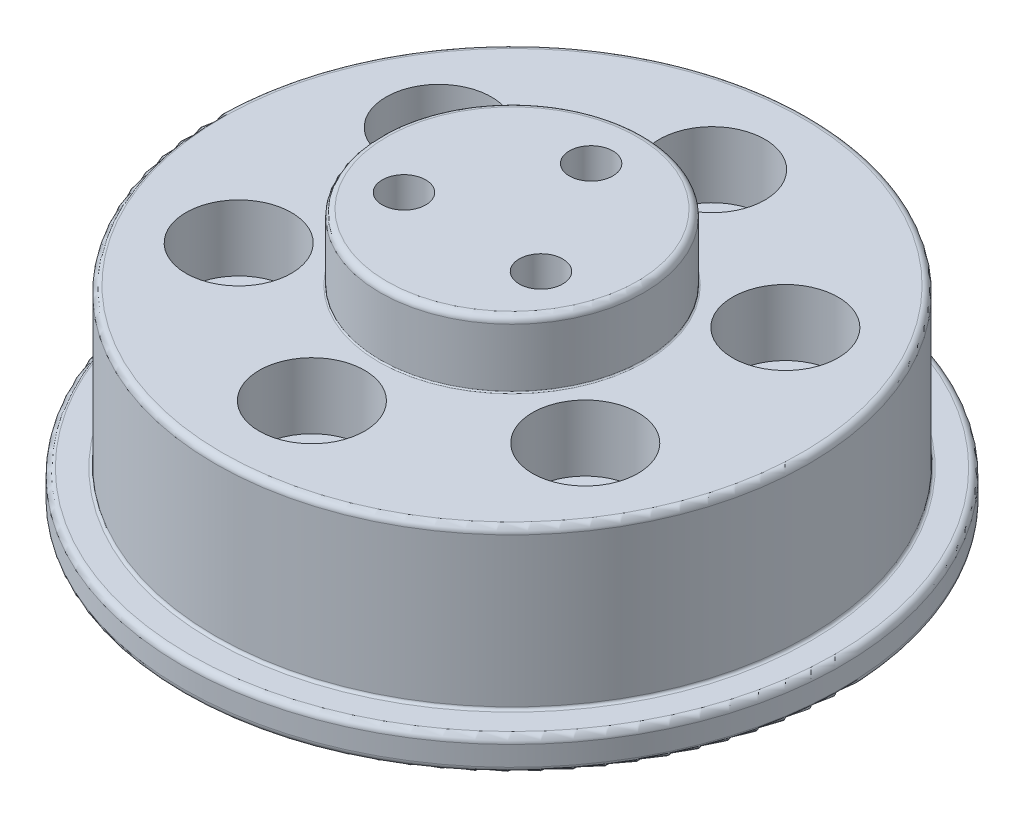
ISO-10303-21;
HEADER;
FILE_DESCRIPTION(('STEP AP214'),'2;1');
FILE_NAME('part.step','',(''),(''),'','','');
FILE_SCHEMA(('AUTOMOTIVE_DESIGN { 1 0 10303 214 1 1 1 1 }'));
ENDSEC;
DATA;
#1=APPLICATION_CONTEXT('core data for automotive mechanical design processes');
#2=APPLICATION_PROTOCOL_DEFINITION('international standard','automotive_design',2000,#1);
#3=PRODUCT_CONTEXT('',#1,'mechanical');
#4=PRODUCT('Part','Part','',(#3));
#5=PRODUCT_RELATED_PRODUCT_CATEGORY('part','',(#4));
#6=PRODUCT_DEFINITION_FORMATION('','',#4);
#7=PRODUCT_DEFINITION_CONTEXT('part definition',#1,'design');
#8=PRODUCT_DEFINITION('design','',#6,#7);
#9=PRODUCT_DEFINITION_SHAPE('','',#8);
#10=(LENGTH_UNIT() NAMED_UNIT(*) SI_UNIT(.MILLI.,.METRE.));
#11=(NAMED_UNIT(*) PLANE_ANGLE_UNIT() SI_UNIT($,.RADIAN.));
#12=(NAMED_UNIT(*) SI_UNIT($,.STERADIAN.) SOLID_ANGLE_UNIT());
#13=UNCERTAINTY_MEASURE_WITH_UNIT(LENGTH_MEASURE(1.E-05),#10,'distance_accuracy_value','');
#14=(GEOMETRIC_REPRESENTATION_CONTEXT(3) GLOBAL_UNCERTAINTY_ASSIGNED_CONTEXT((#13)) GLOBAL_UNIT_ASSIGNED_CONTEXT((#10,
#11,#12)) REPRESENTATION_CONTEXT('',''));
#15=CARTESIAN_POINT('',(0.,0.,0.));
#16=DIRECTION('',(0.,0.,1.));
#17=DIRECTION('',(1.,0.,0.));
#18=AXIS2_PLACEMENT_3D('',#15,#16,#17);
#19=CARTESIAN_POINT('',(0.,2.5,0.));
#20=DIRECTION('',(0.,-1.,0.));
#21=DIRECTION('',(0.,0.,-1.));
#22=AXIS2_PLACEMENT_3D('',#19,#20,#21);
#23=CYLINDRICAL_SURFACE('',#22,10.1);
#24=CARTESIAN_POINT('',(0.,0.5,0.));
#25=DIRECTION('',(0.,1.,0.));
#26=DIRECTION('',(0.,0.,1.));
#27=AXIS2_PLACEMENT_3D('',#24,#25,#26);
#28=CIRCLE('',#27,10.1);
#29=CARTESIAN_POINT('',(0.,0.5,10.1));
#30=VERTEX_POINT('',#29);
#31=EDGE_CURVE('E153',#30,#30,#28,.T.);
#32=ORIENTED_EDGE('',*,*,#31,.T.);
#33=EDGE_LOOP('',(#32));
#34=FACE_BOUND('',#33,.T.);
#35=CARTESIAN_POINT('',(0.,2.,0.));
#36=DIRECTION('',(0.,1.,0.));
#37=DIRECTION('',(0.,0.,1.));
#38=AXIS2_PLACEMENT_3D('',#35,#36,#37);
#39=CIRCLE('',#38,10.1);
#40=CARTESIAN_POINT('',(0.,2.,10.1));
#41=VERTEX_POINT('',#40);
#42=EDGE_CURVE('E140',#41,#41,#39,.F.);
#43=ORIENTED_EDGE('',*,*,#42,.T.);
#44=EDGE_LOOP('',(#43));
#45=FACE_BOUND('',#44,.T.);
#46=ADVANCED_FACE('F33',(#34,#45),#23,.T.);
#47=CARTESIAN_POINT('',(0.,0.,0.));
#48=DIRECTION('',(0.,1.,0.));
#49=DIRECTION('',(0.,0.,1.));
#50=AXIS2_PLACEMENT_3D('',#47,#48,#49);
#51=PLANE('',#50);
#52=CARTESIAN_POINT('',(0.,0.,0.));
#53=DIRECTION('',(0.,1.,0.));
#54=DIRECTION('',(0.,0.,1.));
#55=AXIS2_PLACEMENT_3D('',#52,#53,#54);
#56=CIRCLE('',#55,9.6);
#57=CARTESIAN_POINT('',(0.,0.,9.6));
#58=VERTEX_POINT('',#57);
#59=EDGE_CURVE('E156',#58,#58,#56,.F.);
#60=ORIENTED_EDGE('',*,*,#59,.T.);
#61=EDGE_LOOP('',(#60));
#62=FACE_BOUND('',#61,.T.);
#63=ADVANCED_FACE('F207',(#62),#51,.F.);
#64=CARTESIAN_POINT('',(0.,5.,0.));
#65=DIRECTION('',(0.,-1.,0.));
#66=DIRECTION('',(0.,0.,-1.));
#67=AXIS2_PLACEMENT_3D('',#64,#65,#66);
#68=CYLINDRICAL_SURFACE('',#67,25.);
#69=CARTESIAN_POINT('',(0.,3.,0.));
#70=DIRECTION('',(0.,1.,0.));
#71=DIRECTION('',(0.,0.,1.));
#72=AXIS2_PLACEMENT_3D('',#69,#70,#71);
#73=CIRCLE('',#72,25.);
#74=CARTESIAN_POINT('',(0.,3.,25.));
#75=VERTEX_POINT('',#74);
#76=EDGE_CURVE('E168',#75,#75,#73,.T.);
#77=ORIENTED_EDGE('',*,*,#76,.T.);
#78=EDGE_LOOP('',(#77));
#79=FACE_BOUND('',#78,.T.);
#80=CARTESIAN_POINT('',(0.,4.5,0.));
#81=DIRECTION('',(0.,1.,0.));
#82=DIRECTION('',(0.,0.,1.));
#83=AXIS2_PLACEMENT_3D('',#80,#81,#82);
#84=CIRCLE('',#83,25.);
#85=CARTESIAN_POINT('',(0.,4.5,25.));
#86=VERTEX_POINT('',#85);
#87=EDGE_CURVE('E165',#86,#86,#84,.F.);
#88=ORIENTED_EDGE('',*,*,#87,.T.);
#89=EDGE_LOOP('',(#88));
#90=FACE_BOUND('',#89,.T.);
#91=ADVANCED_FACE('F213',(#79,#90),#68,.T.);
#92=CARTESIAN_POINT('',(0.,5.,0.));
#93=DIRECTION('',(0.,1.,0.));
#94=DIRECTION('',(0.,0.,1.));
#95=AXIS2_PLACEMENT_3D('',#92,#93,#94);
#96=PLANE('',#95);
#97=CARTESIAN_POINT('',(0.,5.,0.));
#98=DIRECTION('',(0.,1.,0.));
#99=DIRECTION('',(0.,0.,1.));
#100=AXIS2_PLACEMENT_3D('',#97,#98,#99);
#101=CIRCLE('',#100,22.7);
#102=CARTESIAN_POINT('',(0.,5.,22.7));
#103=VERTEX_POINT('',#102);
#104=EDGE_CURVE('E183',#103,#103,#101,.F.);
#105=ORIENTED_EDGE('',*,*,#104,.T.);
#106=EDGE_LOOP('',(#105));
#107=FACE_BOUND('',#106,.T.);
#108=CARTESIAN_POINT('',(0.,5.,0.));
#109=DIRECTION('',(0.,1.,0.));
#110=DIRECTION('',(0.,0.,1.));
#111=AXIS2_PLACEMENT_3D('',#108,#109,#110);
#112=CIRCLE('',#111,24.5);
#113=CARTESIAN_POINT('',(0.,5.,24.5));
#114=VERTEX_POINT('',#113);
#115=EDGE_CURVE('E171',#114,#114,#112,.T.);
#116=ORIENTED_EDGE('',*,*,#115,.T.);
#117=EDGE_LOOP('',(#116));
#118=FACE_BOUND('',#117,.T.);
#119=ADVANCED_FACE('F301',(#107,#118),#96,.T.);
#120=CARTESIAN_POINT('',(0.,2.5,0.));
#121=DIRECTION('',(0.,1.,0.));
#122=DIRECTION('',(0.,0.,1.));
#123=AXIS2_PLACEMENT_3D('',#120,#121,#122);
#124=PLANE('',#123);
#125=CARTESIAN_POINT('',(0.,2.5,0.));
#126=DIRECTION('',(0.,1.,0.));
#127=DIRECTION('',(0.,0.,1.));
#128=AXIS2_PLACEMENT_3D('',#125,#126,#127);
#129=CIRCLE('',#128,10.6);
#130=CARTESIAN_POINT('',(0.,2.5,10.6));
#131=VERTEX_POINT('',#130);
#132=EDGE_CURVE('E162',#131,#131,#129,.T.);
#133=ORIENTED_EDGE('',*,*,#132,.T.);
#134=EDGE_LOOP('',(#133));
#135=FACE_BOUND('',#134,.T.);
#136=CARTESIAN_POINT('',(0.,2.5,0.));
#137=DIRECTION('',(0.,1.,0.));
#138=DIRECTION('',(0.,0.,1.));
#139=AXIS2_PLACEMENT_3D('',#136,#137,#138);
#140=CIRCLE('',#139,24.5);
#141=CARTESIAN_POINT('',(0.,2.5,24.5));
#142=VERTEX_POINT('',#141);
#143=EDGE_CURVE('E159',#142,#142,#140,.F.);
#144=ORIENTED_EDGE('',*,*,#143,.T.);
#145=EDGE_LOOP('',(#144));
#146=FACE_BOUND('',#145,.T.);
#147=CARTESIAN_POINT('',(13.1462656294477,2.5,-7.59000000000015));
#148=DIRECTION('',(0.,1.,0.));
#149=DIRECTION('',(0.,0.,1.));
#150=AXIS2_PLACEMENT_3D('',#147,#148,#149);
#151=CIRCLE('',#150,2.25);
#152=CARTESIAN_POINT('',(13.1462656294477,2.5,-5.34000000000016));
#153=VERTEX_POINT('',#152);
#154=EDGE_CURVE('E87',#153,#153,#151,.T.);
#155=ORIENTED_EDGE('',*,*,#154,.T.);
#156=EDGE_LOOP('',(#155));
#157=FACE_BOUND('',#156,.T.);
#158=CARTESIAN_POINT('',(13.1462656294478,2.5,7.58999999999988));
#159=DIRECTION('',(0.,1.,0.));
#160=DIRECTION('',(0.,0.,1.));
#161=AXIS2_PLACEMENT_3D('',#158,#159,#160);
#162=CIRCLE('',#161,2.25);
#163=CARTESIAN_POINT('',(13.1462656294478,2.5,9.83999999999988));
#164=VERTEX_POINT('',#163);
#165=EDGE_CURVE('E97',#164,#164,#162,.T.);
#166=ORIENTED_EDGE('',*,*,#165,.T.);
#167=EDGE_LOOP('',(#166));
#168=FACE_BOUND('',#167,.T.);
#169=CARTESIAN_POINT('',(0.,2.5,15.18));
#170=DIRECTION('',(0.,1.,0.));
#171=DIRECTION('',(0.,0.,1.));
#172=AXIS2_PLACEMENT_3D('',#169,#170,#171);
#173=CIRCLE('',#172,2.25);
#174=CARTESIAN_POINT('',(0.,2.5,17.43));
#175=VERTEX_POINT('',#174);
#176=EDGE_CURVE('E107',#175,#175,#173,.T.);
#177=ORIENTED_EDGE('',*,*,#176,.T.);
#178=EDGE_LOOP('',(#177));
#179=FACE_BOUND('',#178,.T.);
#180=CARTESIAN_POINT('',(-13.1462656294477,2.5,7.59000000000006));
#181=DIRECTION('',(0.,1.,0.));
#182=DIRECTION('',(0.,0.,1.));
#183=AXIS2_PLACEMENT_3D('',#180,#181,#182);
#184=CIRCLE('',#183,2.25);
#185=CARTESIAN_POINT('',(-13.1462656294477,2.5,9.84000000000006));
#186=VERTEX_POINT('',#185);
#187=EDGE_CURVE('E117',#186,#186,#184,.T.);
#188=ORIENTED_EDGE('',*,*,#187,.T.);
#189=EDGE_LOOP('',(#188));
#190=FACE_BOUND('',#189,.T.);
#191=CARTESIAN_POINT('',(-13.1462656294478,2.5,-7.58999999999997));
#192=DIRECTION('',(0.,1.,0.));
#193=DIRECTION('',(0.,0.,1.));
#194=AXIS2_PLACEMENT_3D('',#191,#192,#193);
#195=CIRCLE('',#194,2.25);
#196=CARTESIAN_POINT('',(-13.1462656294478,2.5,-5.33999999999997));
#197=VERTEX_POINT('',#196);
#198=EDGE_CURVE('E127',#197,#197,#195,.T.);
#199=ORIENTED_EDGE('',*,*,#198,.T.);
#200=EDGE_LOOP('',(#199));
#201=FACE_BOUND('',#200,.T.);
#202=CARTESIAN_POINT('',(0.,2.5,-15.18));
#203=DIRECTION('',(0.,1.,0.));
#204=DIRECTION('',(0.,0.,1.));
#205=AXIS2_PLACEMENT_3D('',#202,#203,#204);
#206=CIRCLE('',#205,2.25);
#207=CARTESIAN_POINT('',(0.,2.5,-12.93));
#208=VERTEX_POINT('',#207);
#209=EDGE_CURVE('E137',#208,#208,#206,.T.);
#210=ORIENTED_EDGE('',*,*,#209,.T.);
#211=EDGE_LOOP('',(#210));
#212=FACE_BOUND('',#211,.T.);
#213=ADVANCED_FACE('F251',(#135,#146,#157,#168,#179,#190,#201,#212),#124,.F.);
#214=CARTESIAN_POINT('',(0.,17.,0.));
#215=DIRECTION('',(0.,-1.,0.));
#216=DIRECTION('',(0.,0.,-1.));
#217=AXIS2_PLACEMENT_3D('',#214,#215,#216);
#218=CYLINDRICAL_SURFACE('',#217,22.5);
#219=CARTESIAN_POINT('',(0.,5.2,0.));
#220=DIRECTION('',(0.,1.,0.));
#221=DIRECTION('',(0.,0.,1.));
#222=AXIS2_PLACEMENT_3D('',#219,#220,#221);
#223=CIRCLE('',#222,22.5);
#224=CARTESIAN_POINT('',(0.,5.2,22.5));
#225=VERTEX_POINT('',#224);
#226=EDGE_CURVE('E180',#225,#225,#223,.T.);
#227=ORIENTED_EDGE('',*,*,#226,.T.);
#228=EDGE_LOOP('',(#227));
#229=FACE_BOUND('',#228,.T.);
#230=CARTESIAN_POINT('',(0.,16.5,0.));
#231=DIRECTION('',(0.,1.,0.));
#232=DIRECTION('',(0.,0.,1.));
#233=AXIS2_PLACEMENT_3D('',#230,#231,#232);
#234=CIRCLE('',#233,22.5);
#235=CARTESIAN_POINT('',(0.,16.5,22.5));
#236=VERTEX_POINT('',#235);
#237=EDGE_CURVE('E177',#236,#236,#234,.F.);
#238=ORIENTED_EDGE('',*,*,#237,.T.);
#239=EDGE_LOOP('',(#238));
#240=FACE_BOUND('',#239,.T.);
#241=ADVANCED_FACE('F247',(#229,#240),#218,.T.);
#242=CARTESIAN_POINT('',(0.,17.,0.));
#243=DIRECTION('',(0.,1.,0.));
#244=DIRECTION('',(0.,0.,1.));
#245=AXIS2_PLACEMENT_3D('',#242,#243,#244);
#246=PLANE('',#245);
#247=CARTESIAN_POINT('',(0.,17.,0.));
#248=DIRECTION('',(0.,1.,0.));
#249=DIRECTION('',(0.,0.,1.));
#250=AXIS2_PLACEMENT_3D('',#247,#248,#249);
#251=CIRCLE('',#250,10.1);
#252=CARTESIAN_POINT('',(0.,17.,10.1));
#253=VERTEX_POINT('',#252);
#254=EDGE_CURVE('E189',#253,#253,#251,.F.);
#255=ORIENTED_EDGE('',*,*,#254,.T.);
#256=EDGE_LOOP('',(#255));
#257=FACE_BOUND('',#256,.T.);
#258=CARTESIAN_POINT('',(0.,17.,0.));
#259=DIRECTION('',(0.,1.,0.));
#260=DIRECTION('',(0.,0.,1.));
#261=AXIS2_PLACEMENT_3D('',#258,#259,#260);
#262=CIRCLE('',#261,22.);
#263=CARTESIAN_POINT('',(0.,17.,22.));
#264=VERTEX_POINT('',#263);
#265=EDGE_CURVE('E174',#264,#264,#262,.T.);
#266=ORIENTED_EDGE('',*,*,#265,.T.);
#267=EDGE_LOOP('',(#266));
#268=FACE_BOUND('',#267,.T.);
#269=CARTESIAN_POINT('',(13.1462656294477,17.,-7.59000000000015));
#270=DIRECTION('',(0.,1.,0.));
#271=DIRECTION('',(0.,0.,1.));
#272=AXIS2_PLACEMENT_3D('',#269,#270,#271);
#273=CIRCLE('',#272,4.);
#274=CARTESIAN_POINT('',(13.1462656294477,17.,-3.59000000000016));
#275=VERTEX_POINT('',#274);
#276=EDGE_CURVE('E78',#275,#275,#273,.T.);
#277=ORIENTED_EDGE('',*,*,#276,.F.);
#278=EDGE_LOOP('',(#277));
#279=FACE_BOUND('',#278,.T.);
#280=CARTESIAN_POINT('',(13.1462656294478,17.,7.58999999999988));
#281=DIRECTION('',(0.,1.,0.));
#282=DIRECTION('',(0.,0.,1.));
#283=AXIS2_PLACEMENT_3D('',#280,#281,#282);
#284=CIRCLE('',#283,4.);
#285=CARTESIAN_POINT('',(13.1462656294478,17.,11.5899999999999));
#286=VERTEX_POINT('',#285);
#287=EDGE_CURVE('E88',#286,#286,#284,.T.);
#288=ORIENTED_EDGE('',*,*,#287,.F.);
#289=EDGE_LOOP('',(#288));
#290=FACE_BOUND('',#289,.T.);
#291=CARTESIAN_POINT('',(0.,17.,15.18));
#292=DIRECTION('',(0.,1.,0.));
#293=DIRECTION('',(0.,0.,1.));
#294=AXIS2_PLACEMENT_3D('',#291,#292,#293);
#295=CIRCLE('',#294,4.);
#296=CARTESIAN_POINT('',(0.,17.,19.18));
#297=VERTEX_POINT('',#296);
#298=EDGE_CURVE('E98',#297,#297,#295,.T.);
#299=ORIENTED_EDGE('',*,*,#298,.F.);
#300=EDGE_LOOP('',(#299));
#301=FACE_BOUND('',#300,.T.);
#302=CARTESIAN_POINT('',(-13.1462656294477,17.,7.59000000000006));
#303=DIRECTION('',(0.,1.,0.));
#304=DIRECTION('',(0.,0.,1.));
#305=AXIS2_PLACEMENT_3D('',#302,#303,#304);
#306=CIRCLE('',#305,4.);
#307=CARTESIAN_POINT('',(-13.1462656294477,17.,11.5900000000001));
#308=VERTEX_POINT('',#307);
#309=EDGE_CURVE('E108',#308,#308,#306,.T.);
#310=ORIENTED_EDGE('',*,*,#309,.F.);
#311=EDGE_LOOP('',(#310));
#312=FACE_BOUND('',#311,.T.);
#313=CARTESIAN_POINT('',(-13.1462656294478,17.,-7.58999999999997));
#314=DIRECTION('',(0.,1.,0.));
#315=DIRECTION('',(0.,0.,1.));
#316=AXIS2_PLACEMENT_3D('',#313,#314,#315);
#317=CIRCLE('',#316,4.);
#318=CARTESIAN_POINT('',(-13.1462656294478,17.,-3.58999999999997));
#319=VERTEX_POINT('',#318);
#320=EDGE_CURVE('E118',#319,#319,#317,.T.);
#321=ORIENTED_EDGE('',*,*,#320,.F.);
#322=EDGE_LOOP('',(#321));
#323=FACE_BOUND('',#322,.T.);
#324=CARTESIAN_POINT('',(0.,17.,-15.18));
#325=DIRECTION('',(0.,1.,0.));
#326=DIRECTION('',(0.,0.,1.));
#327=AXIS2_PLACEMENT_3D('',#324,#325,#326);
#328=CIRCLE('',#327,4.);
#329=CARTESIAN_POINT('',(0.,17.,-11.18));
#330=VERTEX_POINT('',#329);
#331=EDGE_CURVE('E128',#330,#330,#328,.T.);
#332=ORIENTED_EDGE('',*,*,#331,.F.);
#333=EDGE_LOOP('',(#332));
#334=FACE_BOUND('',#333,.T.);
#335=ADVANCED_FACE('F250',(#257,#268,#279,#290,#301,#312,#323,#334),#246,.T.);
#336=CARTESIAN_POINT('',(0.,22.,0.));
#337=DIRECTION('',(0.,-1.,0.));
#338=DIRECTION('',(0.,0.,-1.));
#339=AXIS2_PLACEMENT_3D('',#336,#337,#338);
#340=CYLINDRICAL_SURFACE('',#339,10.);
#341=CARTESIAN_POINT('',(0.,21.5,0.));
#342=DIRECTION('',(0.,1.,0.));
#343=DIRECTION('',(0.,0.,1.));
#344=AXIS2_PLACEMENT_3D('',#341,#342,#343);
#345=CIRCLE('',#344,10.);
#346=CARTESIAN_POINT('',(0.,21.5,10.));
#347=VERTEX_POINT('',#346);
#348=EDGE_CURVE('E11',#347,#347,#345,.F.);
#349=ORIENTED_EDGE('',*,*,#348,.T.);
#350=EDGE_LOOP('',(#349));
#351=FACE_BOUND('',#350,.T.);
#352=CARTESIAN_POINT('',(0.,17.1,0.));
#353=DIRECTION('',(0.,1.,0.));
#354=DIRECTION('',(0.,0.,1.));
#355=AXIS2_PLACEMENT_3D('',#352,#353,#354);
#356=CIRCLE('',#355,10.);
#357=CARTESIAN_POINT('',(0.,17.1,10.));
#358=VERTEX_POINT('',#357);
#359=EDGE_CURVE('E186',#358,#358,#356,.T.);
#360=ORIENTED_EDGE('',*,*,#359,.T.);
#361=EDGE_LOOP('',(#360));
#362=FACE_BOUND('',#361,.T.);
#363=ADVANCED_FACE('F259',(#351,#362),#340,.T.);
#364=CARTESIAN_POINT('',(0.,22.,0.));
#365=DIRECTION('',(0.,1.,0.));
#366=DIRECTION('',(0.,0.,1.));
#367=AXIS2_PLACEMENT_3D('',#364,#365,#366);
#368=PLANE('',#367);
#369=CARTESIAN_POINT('',(0.,22.,0.));
#370=DIRECTION('',(0.,1.,0.));
#371=DIRECTION('',(0.,0.,1.));
#372=AXIS2_PLACEMENT_3D('',#369,#370,#371);
#373=CIRCLE('',#372,9.5);
#374=CARTESIAN_POINT('',(0.,22.,9.5));
#375=VERTEX_POINT('',#374);
#376=EDGE_CURVE('E41',#375,#375,#373,.T.);
#377=ORIENTED_EDGE('',*,*,#376,.T.);
#378=EDGE_LOOP('',(#377));
#379=FACE_BOUND('',#378,.T.);
#380=CARTESIAN_POINT('',(5.19615242270666,22.,2.99999999999995));
#381=DIRECTION('',(0.,1.,0.));
#382=DIRECTION('',(0.,0.,1.));
#383=AXIS2_PLACEMENT_3D('',#380,#381,#382);
#384=CIRCLE('',#383,1.64999999999999);
#385=CARTESIAN_POINT('',(5.19615242270666,22.,4.64999999999994));
#386=VERTEX_POINT('',#385);
#387=EDGE_CURVE('E62',#386,#386,#384,.T.);
#388=ORIENTED_EDGE('',*,*,#387,.F.);
#389=EDGE_LOOP('',(#388));
#390=FACE_BOUND('',#389,.T.);
#391=CARTESIAN_POINT('',(-5.19615242270662,22.,3.00000000000002));
#392=DIRECTION('',(0.,1.,0.));
#393=DIRECTION('',(0.,0.,1.));
#394=AXIS2_PLACEMENT_3D('',#391,#392,#393);
#395=CIRCLE('',#394,1.64999999999999);
#396=CARTESIAN_POINT('',(-5.19615242270662,22.,4.65000000000002));
#397=VERTEX_POINT('',#396);
#398=EDGE_CURVE('E61',#397,#397,#395,.T.);
#399=ORIENTED_EDGE('',*,*,#398,.F.);
#400=EDGE_LOOP('',(#399));
#401=FACE_BOUND('',#400,.T.);
#402=CARTESIAN_POINT('',(0.,22.,-6.));
#403=DIRECTION('',(0.,1.,0.));
#404=DIRECTION('',(0.,0.,1.));
#405=AXIS2_PLACEMENT_3D('',#402,#403,#404);
#406=CIRCLE('',#405,1.64999999999999);
#407=CARTESIAN_POINT('',(0.,22.,-4.35000000000001));
#408=VERTEX_POINT('',#407);
#409=EDGE_CURVE('E72',#408,#408,#406,.T.);
#410=ORIENTED_EDGE('',*,*,#409,.F.);
#411=EDGE_LOOP('',(#410));
#412=FACE_BOUND('',#411,.T.);
#413=ADVANCED_FACE('F194',(#379,#390,#401,#412),#368,.T.);
#414=CARTESIAN_POINT('',(0.,17.,-15.18));
#415=DIRECTION('',(0.,1.,0.));
#416=DIRECTION('',(0.,0.,1.));
#417=AXIS2_PLACEMENT_3D('',#414,#415,#416);
#418=CYLINDRICAL_SURFACE('',#417,2.25);
#419=CARTESIAN_POINT('',(0.,12.,-15.18));
#420=DIRECTION('',(0.,1.,0.));
#421=DIRECTION('',(0.,0.,1.));
#422=AXIS2_PLACEMENT_3D('',#419,#420,#421);
#423=CIRCLE('',#422,2.25);
#424=CARTESIAN_POINT('',(0.,12.,-12.93));
#425=VERTEX_POINT('',#424);
#426=EDGE_CURVE('E134',#425,#425,#423,.T.);
#427=ORIENTED_EDGE('',*,*,#426,.T.);
#428=EDGE_LOOP('',(#427));
#429=FACE_BOUND('',#428,.T.);
#430=ORIENTED_EDGE('',*,*,#209,.F.);
#431=EDGE_LOOP('',(#430));
#432=FACE_BOUND('',#431,.T.);
#433=ADVANCED_FACE('F287',(#429,#432),#418,.F.);
#434=CARTESIAN_POINT('',(2.25,12.,-15.18));
#435=DIRECTION('',(0.,-1.,0.));
#436=DIRECTION('',(0.,0.,-1.));
#437=AXIS2_PLACEMENT_3D('',#434,#435,#436);
#438=PLANE('',#437);
#439=ORIENTED_EDGE('',*,*,#426,.F.);
#440=EDGE_LOOP('',(#439));
#441=FACE_BOUND('',#440,.T.);
#442=CARTESIAN_POINT('',(0.,12.,-15.18));
#443=DIRECTION('',(0.,1.,0.));
#444=DIRECTION('',(0.,0.,1.));
#445=AXIS2_PLACEMENT_3D('',#442,#443,#444);
#446=CIRCLE('',#445,4.);
#447=CARTESIAN_POINT('',(0.,12.,-11.18));
#448=VERTEX_POINT('',#447);
#449=EDGE_CURVE('E131',#448,#448,#446,.T.);
#450=ORIENTED_EDGE('',*,*,#449,.T.);
#451=EDGE_LOOP('',(#450));
#452=FACE_BOUND('',#451,.T.);
#453=ADVANCED_FACE('F277',(#441,#452),#438,.F.);
#454=CARTESIAN_POINT('',(0.,17.,-15.18));
#455=DIRECTION('',(0.,1.,0.));
#456=DIRECTION('',(0.,0.,1.));
#457=AXIS2_PLACEMENT_3D('',#454,#455,#456);
#458=CYLINDRICAL_SURFACE('',#457,4.);
#459=ORIENTED_EDGE('',*,*,#449,.F.);
#460=EDGE_LOOP('',(#459));
#461=FACE_BOUND('',#460,.T.);
#462=ORIENTED_EDGE('',*,*,#331,.T.);
#463=EDGE_LOOP('',(#462));
#464=FACE_BOUND('',#463,.T.);
#465=ADVANCED_FACE('F274',(#461,#464),#458,.F.);
#466=CARTESIAN_POINT('',(-13.1462656294478,17.,-7.58999999999997));
#467=DIRECTION('',(0.,1.,0.));
#468=DIRECTION('',(0.,0.,1.));
#469=AXIS2_PLACEMENT_3D('',#466,#467,#468);
#470=CYLINDRICAL_SURFACE('',#469,2.25);
#471=CARTESIAN_POINT('',(-13.1462656294478,12.,-7.58999999999997));
#472=DIRECTION('',(0.,1.,0.));
#473=DIRECTION('',(0.,0.,1.));
#474=AXIS2_PLACEMENT_3D('',#471,#472,#473);
#475=CIRCLE('',#474,2.25);
#476=CARTESIAN_POINT('',(-13.1462656294478,12.,-5.33999999999997));
#477=VERTEX_POINT('',#476);
#478=EDGE_CURVE('E124',#477,#477,#475,.T.);
#479=ORIENTED_EDGE('',*,*,#478,.T.);
#480=EDGE_LOOP('',(#479));
#481=FACE_BOUND('',#480,.T.);
#482=ORIENTED_EDGE('',*,*,#198,.F.);
#483=EDGE_LOOP('',(#482));
#484=FACE_BOUND('',#483,.T.);
#485=ADVANCED_FACE('F276',(#481,#484),#470,.F.);
#486=CARTESIAN_POINT('',(-10.8962656294478,12.,-7.58999999999997));
#487=DIRECTION('',(0.,-1.,0.));
#488=DIRECTION('',(0.,0.,-1.));
#489=AXIS2_PLACEMENT_3D('',#486,#487,#488);
#490=PLANE('',#489);
#491=ORIENTED_EDGE('',*,*,#478,.F.);
#492=EDGE_LOOP('',(#491));
#493=FACE_BOUND('',#492,.T.);
#494=CARTESIAN_POINT('',(-13.1462656294478,12.,-7.58999999999997));
#495=DIRECTION('',(0.,1.,0.));
#496=DIRECTION('',(0.,0.,1.));
#497=AXIS2_PLACEMENT_3D('',#494,#495,#496);
#498=CIRCLE('',#497,4.);
#499=CARTESIAN_POINT('',(-13.1462656294478,12.,-3.58999999999997));
#500=VERTEX_POINT('',#499);
#501=EDGE_CURVE('E121',#500,#500,#498,.T.);
#502=ORIENTED_EDGE('',*,*,#501,.T.);
#503=EDGE_LOOP('',(#502));
#504=FACE_BOUND('',#503,.T.);
#505=ADVANCED_FACE('F284',(#493,#504),#490,.F.);
#506=CARTESIAN_POINT('',(-13.1462656294478,17.,-7.58999999999997));
#507=DIRECTION('',(0.,1.,0.));
#508=DIRECTION('',(0.,0.,1.));
#509=AXIS2_PLACEMENT_3D('',#506,#507,#508);
#510=CYLINDRICAL_SURFACE('',#509,4.);
#511=ORIENTED_EDGE('',*,*,#501,.F.);
#512=EDGE_LOOP('',(#511));
#513=FACE_BOUND('',#512,.T.);
#514=ORIENTED_EDGE('',*,*,#320,.T.);
#515=EDGE_LOOP('',(#514));
#516=FACE_BOUND('',#515,.T.);
#517=ADVANCED_FACE('F374',(#513,#516),#510,.F.);
#518=CARTESIAN_POINT('',(-13.1462656294477,17.,7.59000000000006));
#519=DIRECTION('',(0.,1.,0.));
#520=DIRECTION('',(0.,0.,1.));
#521=AXIS2_PLACEMENT_3D('',#518,#519,#520);
#522=CYLINDRICAL_SURFACE('',#521,2.25);
#523=CARTESIAN_POINT('',(-13.1462656294477,12.,7.59000000000006));
#524=DIRECTION('',(0.,1.,0.));
#525=DIRECTION('',(0.,0.,1.));
#526=AXIS2_PLACEMENT_3D('',#523,#524,#525);
#527=CIRCLE('',#526,2.25);
#528=CARTESIAN_POINT('',(-13.1462656294477,12.,9.84000000000006));
#529=VERTEX_POINT('',#528);
#530=EDGE_CURVE('E114',#529,#529,#527,.T.);
#531=ORIENTED_EDGE('',*,*,#530,.T.);
#532=EDGE_LOOP('',(#531));
#533=FACE_BOUND('',#532,.T.);
#534=ORIENTED_EDGE('',*,*,#187,.F.);
#535=EDGE_LOOP('',(#534));
#536=FACE_BOUND('',#535,.T.);
#537=ADVANCED_FACE('F383',(#533,#536),#522,.F.);
#538=CARTESIAN_POINT('',(-10.8962656294477,12.,7.59000000000006));
#539=DIRECTION('',(0.,-1.,0.));
#540=DIRECTION('',(0.,0.,-1.));
#541=AXIS2_PLACEMENT_3D('',#538,#539,#540);
#542=PLANE('',#541);
#543=ORIENTED_EDGE('',*,*,#530,.F.);
#544=EDGE_LOOP('',(#543));
#545=FACE_BOUND('',#544,.T.);
#546=CARTESIAN_POINT('',(-13.1462656294477,12.,7.59000000000006));
#547=DIRECTION('',(0.,1.,0.));
#548=DIRECTION('',(0.,0.,1.));
#549=AXIS2_PLACEMENT_3D('',#546,#547,#548);
#550=CIRCLE('',#549,4.);
#551=CARTESIAN_POINT('',(-13.1462656294477,12.,11.5900000000001));
#552=VERTEX_POINT('',#551);
#553=EDGE_CURVE('E111',#552,#552,#550,.T.);
#554=ORIENTED_EDGE('',*,*,#553,.T.);
#555=EDGE_LOOP('',(#554));
#556=FACE_BOUND('',#555,.T.);
#557=ADVANCED_FACE('F393',(#545,#556),#542,.F.);
#558=CARTESIAN_POINT('',(-13.1462656294477,17.,7.59000000000006));
#559=DIRECTION('',(0.,1.,0.));
#560=DIRECTION('',(0.,0.,1.));
#561=AXIS2_PLACEMENT_3D('',#558,#559,#560);
#562=CYLINDRICAL_SURFACE('',#561,4.);
#563=ORIENTED_EDGE('',*,*,#553,.F.);
#564=EDGE_LOOP('',(#563));
#565=FACE_BOUND('',#564,.T.);
#566=ORIENTED_EDGE('',*,*,#309,.T.);
#567=EDGE_LOOP('',(#566));
#568=FACE_BOUND('',#567,.T.);
#569=ADVANCED_FACE('F403',(#565,#568),#562,.F.);
#570=CARTESIAN_POINT('',(0.,17.,15.18));
#571=DIRECTION('',(0.,1.,0.));
#572=DIRECTION('',(0.,0.,1.));
#573=AXIS2_PLACEMENT_3D('',#570,#571,#572);
#574=CYLINDRICAL_SURFACE('',#573,2.25);
#575=CARTESIAN_POINT('',(0.,12.,15.18));
#576=DIRECTION('',(0.,1.,0.));
#577=DIRECTION('',(0.,0.,1.));
#578=AXIS2_PLACEMENT_3D('',#575,#576,#577);
#579=CIRCLE('',#578,2.25);
#580=CARTESIAN_POINT('',(0.,12.,17.43));
#581=VERTEX_POINT('',#580);
#582=EDGE_CURVE('E104',#581,#581,#579,.T.);
#583=ORIENTED_EDGE('',*,*,#582,.T.);
#584=EDGE_LOOP('',(#583));
#585=FACE_BOUND('',#584,.T.);
#586=ORIENTED_EDGE('',*,*,#176,.F.);
#587=EDGE_LOOP('',(#586));
#588=FACE_BOUND('',#587,.T.);
#589=ADVANCED_FACE('F413',(#585,#588),#574,.F.);
#590=CARTESIAN_POINT('',(2.25,12.,15.18));
#591=DIRECTION('',(0.,-1.,0.));
#592=DIRECTION('',(0.,0.,-1.));
#593=AXIS2_PLACEMENT_3D('',#590,#591,#592);
#594=PLANE('',#593);
#595=ORIENTED_EDGE('',*,*,#582,.F.);
#596=EDGE_LOOP('',(#595));
#597=FACE_BOUND('',#596,.T.);
#598=CARTESIAN_POINT('',(0.,12.,15.18));
#599=DIRECTION('',(0.,1.,0.));
#600=DIRECTION('',(0.,0.,1.));
#601=AXIS2_PLACEMENT_3D('',#598,#599,#600);
#602=CIRCLE('',#601,4.);
#603=CARTESIAN_POINT('',(0.,12.,19.18));
#604=VERTEX_POINT('',#603);
#605=EDGE_CURVE('E101',#604,#604,#602,.T.);
#606=ORIENTED_EDGE('',*,*,#605,.T.);
#607=EDGE_LOOP('',(#606));
#608=FACE_BOUND('',#607,.T.);
#609=ADVANCED_FACE('F423',(#597,#608),#594,.F.);
#610=CARTESIAN_POINT('',(0.,17.,15.18));
#611=DIRECTION('',(0.,1.,0.));
#612=DIRECTION('',(0.,0.,1.));
#613=AXIS2_PLACEMENT_3D('',#610,#611,#612);
#614=CYLINDRICAL_SURFACE('',#613,4.);
#615=ORIENTED_EDGE('',*,*,#605,.F.);
#616=EDGE_LOOP('',(#615));
#617=FACE_BOUND('',#616,.T.);
#618=ORIENTED_EDGE('',*,*,#298,.T.);
#619=EDGE_LOOP('',(#618));
#620=FACE_BOUND('',#619,.T.);
#621=ADVANCED_FACE('F433',(#617,#620),#614,.F.);
#622=CARTESIAN_POINT('',(13.1462656294478,17.,7.58999999999988));
#623=DIRECTION('',(0.,1.,0.));
#624=DIRECTION('',(0.,0.,1.));
#625=AXIS2_PLACEMENT_3D('',#622,#623,#624);
#626=CYLINDRICAL_SURFACE('',#625,2.25);
#627=CARTESIAN_POINT('',(13.1462656294478,12.,7.58999999999988));
#628=DIRECTION('',(0.,1.,0.));
#629=DIRECTION('',(0.,0.,1.));
#630=AXIS2_PLACEMENT_3D('',#627,#628,#629);
#631=CIRCLE('',#630,2.25);
#632=CARTESIAN_POINT('',(13.1462656294478,12.,9.83999999999988));
#633=VERTEX_POINT('',#632);
#634=EDGE_CURVE('E94',#633,#633,#631,.T.);
#635=ORIENTED_EDGE('',*,*,#634,.T.);
#636=EDGE_LOOP('',(#635));
#637=FACE_BOUND('',#636,.T.);
#638=ORIENTED_EDGE('',*,*,#165,.F.);
#639=EDGE_LOOP('',(#638));
#640=FACE_BOUND('',#639,.T.);
#641=ADVANCED_FACE('F443',(#637,#640),#626,.F.);
#642=CARTESIAN_POINT('',(15.3962656294478,12.,7.58999999999988));
#643=DIRECTION('',(0.,-1.,0.));
#644=DIRECTION('',(0.,0.,-1.));
#645=AXIS2_PLACEMENT_3D('',#642,#643,#644);
#646=PLANE('',#645);
#647=ORIENTED_EDGE('',*,*,#634,.F.);
#648=EDGE_LOOP('',(#647));
#649=FACE_BOUND('',#648,.T.);
#650=CARTESIAN_POINT('',(13.1462656294478,12.,7.58999999999988));
#651=DIRECTION('',(0.,1.,0.));
#652=DIRECTION('',(0.,0.,1.));
#653=AXIS2_PLACEMENT_3D('',#650,#651,#652);
#654=CIRCLE('',#653,4.);
#655=CARTESIAN_POINT('',(13.1462656294478,12.,11.5899999999999));
#656=VERTEX_POINT('',#655);
#657=EDGE_CURVE('E91',#656,#656,#654,.T.);
#658=ORIENTED_EDGE('',*,*,#657,.T.);
#659=EDGE_LOOP('',(#658));
#660=FACE_BOUND('',#659,.T.);
#661=ADVANCED_FACE('F453',(#649,#660),#646,.F.);
#662=CARTESIAN_POINT('',(13.1462656294478,17.,7.58999999999988));
#663=DIRECTION('',(0.,1.,0.));
#664=DIRECTION('',(0.,0.,1.));
#665=AXIS2_PLACEMENT_3D('',#662,#663,#664);
#666=CYLINDRICAL_SURFACE('',#665,4.);
#667=ORIENTED_EDGE('',*,*,#657,.F.);
#668=EDGE_LOOP('',(#667));
#669=FACE_BOUND('',#668,.T.);
#670=ORIENTED_EDGE('',*,*,#287,.T.);
#671=EDGE_LOOP('',(#670));
#672=FACE_BOUND('',#671,.T.);
#673=ADVANCED_FACE('F463',(#669,#672),#666,.F.);
#674=CARTESIAN_POINT('',(13.1462656294477,17.,-7.59000000000015));
#675=DIRECTION('',(0.,1.,0.));
#676=DIRECTION('',(0.,0.,1.));
#677=AXIS2_PLACEMENT_3D('',#674,#675,#676);
#678=CYLINDRICAL_SURFACE('',#677,2.25);
#679=CARTESIAN_POINT('',(13.1462656294477,12.,-7.59000000000015));
#680=DIRECTION('',(0.,1.,0.));
#681=DIRECTION('',(0.,0.,1.));
#682=AXIS2_PLACEMENT_3D('',#679,#680,#681);
#683=CIRCLE('',#682,2.25);
#684=CARTESIAN_POINT('',(13.1462656294477,12.,-5.34000000000015));
#685=VERTEX_POINT('',#684);
#686=EDGE_CURVE('E84',#685,#685,#683,.T.);
#687=ORIENTED_EDGE('',*,*,#686,.T.);
#688=EDGE_LOOP('',(#687));
#689=FACE_BOUND('',#688,.T.);
#690=ORIENTED_EDGE('',*,*,#154,.F.);
#691=EDGE_LOOP('',(#690));
#692=FACE_BOUND('',#691,.T.);
#693=ADVANCED_FACE('F473',(#689,#692),#678,.F.);
#694=CARTESIAN_POINT('',(15.3962656294477,12.,-7.59000000000015));
#695=DIRECTION('',(0.,-1.,0.));
#696=DIRECTION('',(0.,0.,-1.));
#697=AXIS2_PLACEMENT_3D('',#694,#695,#696);
#698=PLANE('',#697);
#699=ORIENTED_EDGE('',*,*,#686,.F.);
#700=EDGE_LOOP('',(#699));
#701=FACE_BOUND('',#700,.T.);
#702=CARTESIAN_POINT('',(13.1462656294477,12.,-7.59000000000015));
#703=DIRECTION('',(0.,1.,0.));
#704=DIRECTION('',(0.,0.,1.));
#705=AXIS2_PLACEMENT_3D('',#702,#703,#704);
#706=CIRCLE('',#705,4.);
#707=CARTESIAN_POINT('',(13.1462656294477,12.,-3.59000000000016));
#708=VERTEX_POINT('',#707);
#709=EDGE_CURVE('E81',#708,#708,#706,.T.);
#710=ORIENTED_EDGE('',*,*,#709,.T.);
#711=EDGE_LOOP('',(#710));
#712=FACE_BOUND('',#711,.T.);
#713=ADVANCED_FACE('F483',(#701,#712),#698,.F.);
#714=CARTESIAN_POINT('',(13.1462656294477,17.,-7.59000000000015));
#715=DIRECTION('',(0.,1.,0.));
#716=DIRECTION('',(0.,0.,1.));
#717=AXIS2_PLACEMENT_3D('',#714,#715,#716);
#718=CYLINDRICAL_SURFACE('',#717,4.);
#719=ORIENTED_EDGE('',*,*,#709,.F.);
#720=EDGE_LOOP('',(#719));
#721=FACE_BOUND('',#720,.T.);
#722=ORIENTED_EDGE('',*,*,#276,.T.);
#723=EDGE_LOOP('',(#722));
#724=FACE_BOUND('',#723,.T.);
#725=ADVANCED_FACE('F493',(#721,#724),#718,.F.);
#726=CARTESIAN_POINT('',(0.,17.,-6.));
#727=DIRECTION('',(0.,1.,0.));
#728=DIRECTION('',(0.,0.,1.));
#729=AXIS2_PLACEMENT_3D('',#726,#727,#728);
#730=CONICAL_SURFACE('',#729,1.65,1.02974425867665);
#731=CARTESIAN_POINT('',(0.,16.0085799786045,-6.));
#732=VERTEX_POINT('',#731);
#733=VERTEX_LOOP('',#732);
#734=FACE_BOUND('',#733,.T.);
#735=CARTESIAN_POINT('',(0.,17.,-6.));
#736=DIRECTION('',(0.,1.,0.));
#737=DIRECTION('',(0.,0.,1.));
#738=AXIS2_PLACEMENT_3D('',#735,#736,#737);
#739=CIRCLE('',#738,1.65);
#740=CARTESIAN_POINT('',(0.,17.,-4.35));
#741=VERTEX_POINT('',#740);
#742=EDGE_CURVE('E75',#741,#741,#739,.T.);
#743=ORIENTED_EDGE('',*,*,#742,.T.);
#744=EDGE_LOOP('',(#743));
#745=FACE_BOUND('',#744,.T.);
#746=ADVANCED_FACE('F503',(#734,#745),#730,.F.);
#747=CARTESIAN_POINT('',(0.,22.,-6.));
#748=DIRECTION('',(0.,1.,0.));
#749=DIRECTION('',(0.,0.,1.));
#750=AXIS2_PLACEMENT_3D('',#747,#748,#749);
#751=CYLINDRICAL_SURFACE('',#750,1.64999999999999);
#752=ORIENTED_EDGE('',*,*,#742,.F.);
#753=EDGE_LOOP('',(#752));
#754=FACE_BOUND('',#753,.T.);
#755=ORIENTED_EDGE('',*,*,#409,.T.);
#756=EDGE_LOOP('',(#755));
#757=FACE_BOUND('',#756,.T.);
#758=ADVANCED_FACE('F513',(#754,#757),#751,.F.);
#759=CARTESIAN_POINT('',(-5.19615242270662,17.,3.00000000000002));
#760=DIRECTION('',(0.,1.,0.));
#761=DIRECTION('',(0.,0.,1.));
#762=AXIS2_PLACEMENT_3D('',#759,#760,#761);
#763=CONICAL_SURFACE('',#762,1.65,1.02974425867665);
#764=CARTESIAN_POINT('',(-5.19615242270662,16.0085799786045,3.00000000000002));
#765=VERTEX_POINT('',#764);
#766=VERTEX_LOOP('',#765);
#767=FACE_BOUND('',#766,.T.);
#768=CARTESIAN_POINT('',(-5.19615242270662,17.,3.00000000000002));
#769=DIRECTION('',(0.,1.,0.));
#770=DIRECTION('',(0.,0.,1.));
#771=AXIS2_PLACEMENT_3D('',#768,#769,#770);
#772=CIRCLE('',#771,1.65);
#773=CARTESIAN_POINT('',(-5.19615242270662,17.,4.65000000000002));
#774=VERTEX_POINT('',#773);
#775=EDGE_CURVE('E65',#774,#774,#772,.T.);
#776=ORIENTED_EDGE('',*,*,#775,.T.);
#777=EDGE_LOOP('',(#776));
#778=FACE_BOUND('',#777,.T.);
#779=ADVANCED_FACE('F522',(#767,#778),#763,.F.);
#780=CARTESIAN_POINT('',(-5.19615242270662,22.,3.00000000000002));
#781=DIRECTION('',(0.,1.,0.));
#782=DIRECTION('',(0.,0.,1.));
#783=AXIS2_PLACEMENT_3D('',#780,#781,#782);
#784=CYLINDRICAL_SURFACE('',#783,1.64999999999999);
#785=ORIENTED_EDGE('',*,*,#775,.F.);
#786=EDGE_LOOP('',(#785));
#787=FACE_BOUND('',#786,.T.);
#788=ORIENTED_EDGE('',*,*,#398,.T.);
#789=EDGE_LOOP('',(#788));
#790=FACE_BOUND('',#789,.T.);
#791=ADVANCED_FACE('F55',(#787,#790),#784,.F.);
#792=CARTESIAN_POINT('',(5.19615242270666,17.,2.99999999999995));
#793=DIRECTION('',(0.,1.,0.));
#794=DIRECTION('',(0.,0.,1.));
#795=AXIS2_PLACEMENT_3D('',#792,#793,#794);
#796=CONICAL_SURFACE('',#795,1.65,1.02974425867665);
#797=CARTESIAN_POINT('',(5.19615242270666,16.0085799786045,2.99999999999995));
#798=VERTEX_POINT('',#797);
#799=VERTEX_LOOP('',#798);
#800=FACE_BOUND('',#799,.T.);
#801=CARTESIAN_POINT('',(5.19615242270666,17.,2.99999999999995));
#802=DIRECTION('',(0.,1.,0.));
#803=DIRECTION('',(0.,0.,1.));
#804=AXIS2_PLACEMENT_3D('',#801,#802,#803);
#805=CIRCLE('',#804,1.65);
#806=CARTESIAN_POINT('',(5.19615242270666,17.,4.64999999999995));
#807=VERTEX_POINT('',#806);
#808=EDGE_CURVE('E59',#807,#807,#805,.T.);
#809=ORIENTED_EDGE('',*,*,#808,.T.);
#810=EDGE_LOOP('',(#809));
#811=FACE_BOUND('',#810,.T.);
#812=ADVANCED_FACE('F51',(#800,#811),#796,.F.);
#813=CARTESIAN_POINT('',(5.19615242270666,22.,2.99999999999995));
#814=DIRECTION('',(0.,1.,0.));
#815=DIRECTION('',(0.,0.,1.));
#816=AXIS2_PLACEMENT_3D('',#813,#814,#815);
#817=CYLINDRICAL_SURFACE('',#816,1.64999999999999);
#818=ORIENTED_EDGE('',*,*,#808,.F.);
#819=EDGE_LOOP('',(#818));
#820=FACE_BOUND('',#819,.T.);
#821=ORIENTED_EDGE('',*,*,#387,.T.);
#822=EDGE_LOOP('',(#821));
#823=FACE_BOUND('',#822,.T.);
#824=ADVANCED_FACE('F54',(#820,#823),#817,.F.);
#825=CARTESIAN_POINT('',(0.,0.5,0.));
#826=DIRECTION('',(0.,1.,0.));
#827=DIRECTION('',(0.,0.,1.));
#828=AXIS2_PLACEMENT_3D('',#825,#826,#827);
#829=TOROIDAL_SURFACE('',#828,9.6,0.5);
#830=ORIENTED_EDGE('',*,*,#59,.F.);
#831=EDGE_LOOP('',(#830));
#832=FACE_BOUND('',#831,.T.);
#833=ORIENTED_EDGE('',*,*,#31,.F.);
#834=EDGE_LOOP('',(#833));
#835=FACE_BOUND('',#834,.T.);
#836=ADVANCED_FACE('F219',(#832,#835),#829,.T.);
#837=CARTESIAN_POINT('',(0.,2.,0.));
#838=DIRECTION('',(0.,1.,0.));
#839=DIRECTION('',(0.,0.,1.));
#840=AXIS2_PLACEMENT_3D('',#837,#838,#839);
#841=TOROIDAL_SURFACE('',#840,10.6,0.5);
#842=ORIENTED_EDGE('',*,*,#42,.F.);
#843=EDGE_LOOP('',(#842));
#844=FACE_BOUND('',#843,.T.);
#845=ORIENTED_EDGE('',*,*,#132,.F.);
#846=EDGE_LOOP('',(#845));
#847=FACE_BOUND('',#846,.T.);
#848=ADVANCED_FACE('F222',(#844,#847),#841,.F.);
#849=CARTESIAN_POINT('',(0.,3.,0.));
#850=DIRECTION('',(0.,1.,0.));
#851=DIRECTION('',(0.,0.,1.));
#852=AXIS2_PLACEMENT_3D('',#849,#850,#851);
#853=TOROIDAL_SURFACE('',#852,24.5,0.5);
#854=ORIENTED_EDGE('',*,*,#143,.F.);
#855=EDGE_LOOP('',(#854));
#856=FACE_BOUND('',#855,.T.);
#857=ORIENTED_EDGE('',*,*,#76,.F.);
#858=EDGE_LOOP('',(#857));
#859=FACE_BOUND('',#858,.T.);
#860=ADVANCED_FACE('F226',(#856,#859),#853,.T.);
#861=CARTESIAN_POINT('',(0.,4.5,0.));
#862=DIRECTION('',(0.,1.,0.));
#863=DIRECTION('',(0.,0.,1.));
#864=AXIS2_PLACEMENT_3D('',#861,#862,#863);
#865=TOROIDAL_SURFACE('',#864,24.5,0.5);
#866=ORIENTED_EDGE('',*,*,#87,.F.);
#867=EDGE_LOOP('',(#866));
#868=FACE_BOUND('',#867,.T.);
#869=ORIENTED_EDGE('',*,*,#115,.F.);
#870=EDGE_LOOP('',(#869));
#871=FACE_BOUND('',#870,.T.);
#872=ADVANCED_FACE('F230',(#868,#871),#865,.T.);
#873=CARTESIAN_POINT('',(0.,16.5,0.));
#874=DIRECTION('',(0.,1.,0.));
#875=DIRECTION('',(0.,0.,1.));
#876=AXIS2_PLACEMENT_3D('',#873,#874,#875);
#877=TOROIDAL_SURFACE('',#876,22.,0.5);
#878=ORIENTED_EDGE('',*,*,#237,.F.);
#879=EDGE_LOOP('',(#878));
#880=FACE_BOUND('',#879,.T.);
#881=ORIENTED_EDGE('',*,*,#265,.F.);
#882=EDGE_LOOP('',(#881));
#883=FACE_BOUND('',#882,.T.);
#884=ADVANCED_FACE('F234',(#880,#883),#877,.T.);
#885=CARTESIAN_POINT('',(0.,5.2,0.));
#886=DIRECTION('',(0.,1.,0.));
#887=DIRECTION('',(0.,0.,1.));
#888=AXIS2_PLACEMENT_3D('',#885,#886,#887);
#889=TOROIDAL_SURFACE('',#888,22.7,0.2);
#890=ORIENTED_EDGE('',*,*,#104,.F.);
#891=EDGE_LOOP('',(#890));
#892=FACE_BOUND('',#891,.T.);
#893=ORIENTED_EDGE('',*,*,#226,.F.);
#894=EDGE_LOOP('',(#893));
#895=FACE_BOUND('',#894,.T.);
#896=ADVANCED_FACE('F203',(#892,#895),#889,.F.);
#897=CARTESIAN_POINT('',(0.,17.1,0.));
#898=DIRECTION('',(0.,1.,0.));
#899=DIRECTION('',(0.,0.,1.));
#900=AXIS2_PLACEMENT_3D('',#897,#898,#899);
#901=TOROIDAL_SURFACE('',#900,10.1,0.1);
#902=ORIENTED_EDGE('',*,*,#254,.F.);
#903=EDGE_LOOP('',(#902));
#904=FACE_BOUND('',#903,.T.);
#905=ORIENTED_EDGE('',*,*,#359,.F.);
#906=EDGE_LOOP('',(#905));
#907=FACE_BOUND('',#906,.T.);
#908=ADVANCED_FACE('F198',(#904,#907),#901,.F.);
#909=CARTESIAN_POINT('',(0.,21.5,0.));
#910=DIRECTION('',(0.,1.,0.));
#911=DIRECTION('',(0.,0.,1.));
#912=AXIS2_PLACEMENT_3D('',#909,#910,#911);
#913=TOROIDAL_SURFACE('',#912,9.5,0.5);
#914=ORIENTED_EDGE('',*,*,#348,.F.);
#915=EDGE_LOOP('',(#914));
#916=FACE_BOUND('',#915,.T.);
#917=ORIENTED_EDGE('',*,*,#376,.F.);
#918=EDGE_LOOP('',(#917));
#919=FACE_BOUND('',#918,.T.);
#920=ADVANCED_FACE('F35',(#916,#919),#913,.T.);
#921=CLOSED_SHELL('',(#46,#63,#91,#119,#213,#241,#335,#363,#413,#433,#453,#465,#485,#505,#517,
#537,#557,#569,#589,#609,#621,#641,#661,#673,#693,#713,#725,#746,#758,#779,#791,#812,#824,#836,
#848,#860,#872,#884,#896,#908,#920));
#922=MANIFOLD_SOLID_BREP('B2',#921);
#923=ADVANCED_BREP_SHAPE_REPRESENTATION('',(#18,#922),#14);
#924=SHAPE_DEFINITION_REPRESENTATION(#9,#923);
ENDSEC;
END-ISO-10303-21;
